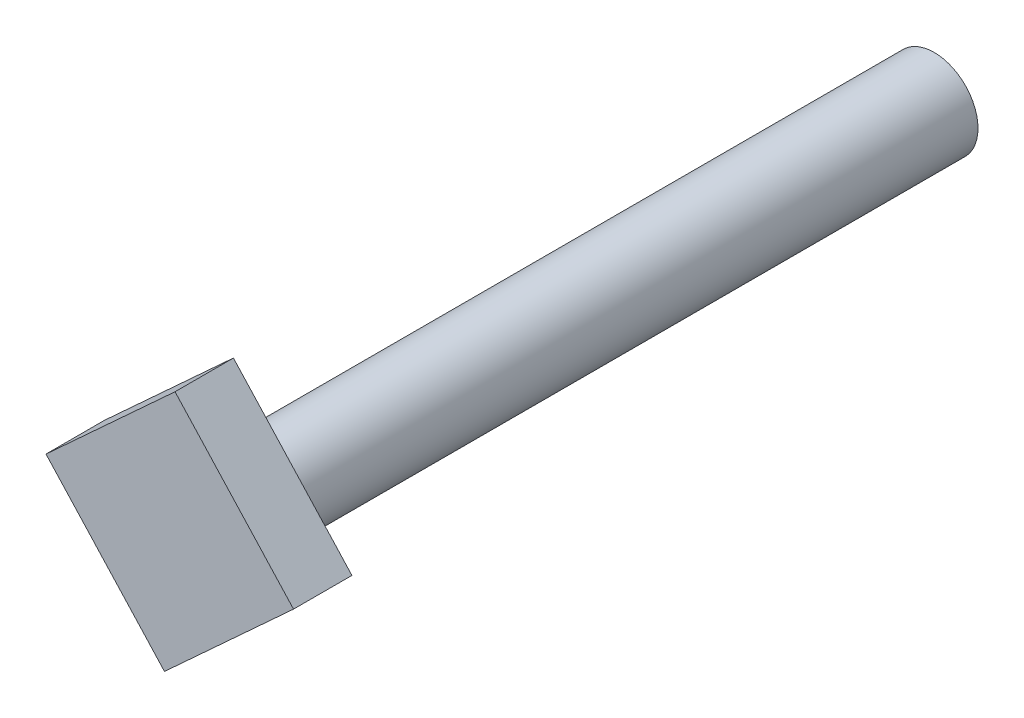
ISO-10303-21;
HEADER;
FILE_DESCRIPTION(('STEP AP214'),'2;1');
FILE_NAME('part.step','',(''),(''),'','','');
FILE_SCHEMA(('AUTOMOTIVE_DESIGN { 1 0 10303 214 1 1 1 1 }'));
ENDSEC;
DATA;
#1=APPLICATION_CONTEXT('core data for automotive mechanical design processes');
#2=APPLICATION_PROTOCOL_DEFINITION('international standard','automotive_design',2000,#1);
#3=PRODUCT_CONTEXT('',#1,'mechanical');
#4=PRODUCT('Part','Part','',(#3));
#5=PRODUCT_RELATED_PRODUCT_CATEGORY('part','',(#4));
#6=PRODUCT_DEFINITION_FORMATION('','',#4);
#7=PRODUCT_DEFINITION_CONTEXT('part definition',#1,'design');
#8=PRODUCT_DEFINITION('design','',#6,#7);
#9=PRODUCT_DEFINITION_SHAPE('','',#8);
#10=(LENGTH_UNIT() NAMED_UNIT(*) SI_UNIT(.MILLI.,.METRE.));
#11=(NAMED_UNIT(*) PLANE_ANGLE_UNIT() SI_UNIT($,.RADIAN.));
#12=(NAMED_UNIT(*) SI_UNIT($,.STERADIAN.) SOLID_ANGLE_UNIT());
#13=UNCERTAINTY_MEASURE_WITH_UNIT(LENGTH_MEASURE(1.E-05),#10,'distance_accuracy_value','');
#14=(GEOMETRIC_REPRESENTATION_CONTEXT(3) GLOBAL_UNCERTAINTY_ASSIGNED_CONTEXT((#13)) GLOBAL_UNIT_ASSIGNED_CONTEXT((#10,
#11,#12)) REPRESENTATION_CONTEXT('',''));
#15=CARTESIAN_POINT('',(0.,0.,0.));
#16=DIRECTION('',(0.,0.,1.));
#17=DIRECTION('',(1.,0.,0.));
#18=AXIS2_PLACEMENT_3D('',#15,#16,#17);
#19=CARTESIAN_POINT('',(0.,17.742533942898,-8.));
#20=DIRECTION('',(0.736588821414821,0.676340822490204,0.));
#21=DIRECTION('',(-0.676340822490204,0.736588821414821,0.));
#22=AXIS2_PLACEMENT_3D('',#19,#20,#21);
#23=PLANE('',#22);
#24=DIRECTION('',(-0.676340822490204,0.736588821414821,0.));
#25=VECTOR('',#24,1.);
#26=CARTESIAN_POINT('',(0.,17.742533942898,0.));
#27=LINE('',#26,#25);
#28=CARTESIAN_POINT('',(16.2321797397649,0.0644022289423118,0.));
#29=VERTEX_POINT('',#28);
#30=CARTESIAN_POINT('',(0.,17.742533942898,0.));
#31=VERTEX_POINT('',#30);
#32=EDGE_CURVE('E102',#29,#31,#27,.T.);
#33=ORIENTED_EDGE('',*,*,#32,.F.);
#34=DIRECTION('',(0.,0.,1.));
#35=VECTOR('',#34,1.);
#36=CARTESIAN_POINT('',(16.2321797397649,0.0644022289423118,-8.));
#37=LINE('',#36,#35);
#38=CARTESIAN_POINT('',(16.2321797397649,0.0644022289423118,-8.));
#39=VERTEX_POINT('',#38);
#40=EDGE_CURVE('E11',#39,#29,#37,.T.);
#41=ORIENTED_EDGE('',*,*,#40,.F.);
#42=DIRECTION('',(-0.676340822490204,0.736588821414821,0.));
#43=VECTOR('',#42,1.);
#44=CARTESIAN_POINT('',(0.,17.742533942898,-8.));
#45=LINE('',#44,#43);
#46=CARTESIAN_POINT('',(0.,17.742533942898,-8.));
#47=VERTEX_POINT('',#46);
#48=EDGE_CURVE('E95',#39,#47,#45,.T.);
#49=ORIENTED_EDGE('',*,*,#48,.T.);
#50=DIRECTION('',(0.,0.,1.));
#51=VECTOR('',#50,1.);
#52=CARTESIAN_POINT('',(0.,17.742533942898,-8.));
#53=LINE('',#52,#51);
#54=EDGE_CURVE('E40',#47,#31,#53,.T.);
#55=ORIENTED_EDGE('',*,*,#54,.T.);
#56=EDGE_LOOP('',(#33,#41,#49,#55));
#57=FACE_BOUND('',#56,.T.);
#58=ADVANCED_FACE('F37',(#57),#23,.T.);
#59=CARTESIAN_POINT('',(-1.4459519741908,-16.1677775108226,-8.));
#60=DIRECTION('',(0.676340822490204,-0.736588821414821,0.));
#61=DIRECTION('',(0.736588821414821,0.676340822490204,0.));
#62=AXIS2_PLACEMENT_3D('',#59,#60,#61);
#63=PLANE('',#62);
#64=DIRECTION('',(0.736588821414821,0.676340822490204,0.));
#65=VECTOR('',#64,1.);
#66=CARTESIAN_POINT('',(-1.4459519741908,-16.1677775108226,0.));
#67=LINE('',#66,#65);
#68=CARTESIAN_POINT('',(-1.4459519741908,-16.1677775108226,0.));
#69=VERTEX_POINT('',#68);
#70=EDGE_CURVE('E97',#69,#29,#67,.T.);
#71=ORIENTED_EDGE('',*,*,#70,.F.);
#72=DIRECTION('',(0.,0.,1.));
#73=VECTOR('',#72,1.);
#74=CARTESIAN_POINT('',(-1.4459519741908,-16.1677775108226,-8.));
#75=LINE('',#74,#73);
#76=CARTESIAN_POINT('',(-1.4459519741908,-16.1677775108226,-8.));
#77=VERTEX_POINT('',#76);
#78=EDGE_CURVE('E46',#77,#69,#75,.T.);
#79=ORIENTED_EDGE('',*,*,#78,.F.);
#80=DIRECTION('',(0.736588821414821,0.676340822490204,0.));
#81=VECTOR('',#80,1.);
#82=CARTESIAN_POINT('',(-1.4459519741908,-16.1677775108226,-8.));
#83=LINE('',#82,#81);
#84=EDGE_CURVE('E92',#77,#39,#83,.T.);
#85=ORIENTED_EDGE('',*,*,#84,.T.);
#86=ORIENTED_EDGE('',*,*,#40,.T.);
#87=EDGE_LOOP('',(#71,#79,#85,#86));
#88=FACE_BOUND('',#87,.T.);
#89=ADVANCED_FACE('F113',(#88),#63,.T.);
#90=CARTESIAN_POINT('',(-17.6781317139557,1.51035420313312,-8.));
#91=DIRECTION('',(-0.736588821414821,-0.676340822490204,0.));
#92=DIRECTION('',(0.676340822490204,-0.736588821414821,0.));
#93=AXIS2_PLACEMENT_3D('',#90,#91,#92);
#94=PLANE('',#93);
#95=DIRECTION('',(0.676340822490204,-0.736588821414821,0.));
#96=VECTOR('',#95,1.);
#97=CARTESIAN_POINT('',(-17.6781317139557,1.51035420313312,0.));
#98=LINE('',#97,#96);
#99=CARTESIAN_POINT('',(-17.6781317139557,1.51035420313312,0.));
#100=VERTEX_POINT('',#99);
#101=EDGE_CURVE('E87',#100,#69,#98,.T.);
#102=ORIENTED_EDGE('',*,*,#101,.F.);
#103=DIRECTION('',(0.,0.,1.));
#104=VECTOR('',#103,1.);
#105=CARTESIAN_POINT('',(-17.6781317139557,1.51035420313312,-8.));
#106=LINE('',#105,#104);
#107=CARTESIAN_POINT('',(-17.6781317139557,1.51035420313312,-8.));
#108=VERTEX_POINT('',#107);
#109=EDGE_CURVE('E82',#108,#100,#106,.T.);
#110=ORIENTED_EDGE('',*,*,#109,.F.);
#111=DIRECTION('',(0.676340822490204,-0.736588821414821,0.));
#112=VECTOR('',#111,1.);
#113=CARTESIAN_POINT('',(-17.6781317139557,1.51035420313312,-8.));
#114=LINE('',#113,#112);
#115=EDGE_CURVE('E85',#108,#77,#114,.T.);
#116=ORIENTED_EDGE('',*,*,#115,.T.);
#117=ORIENTED_EDGE('',*,*,#78,.T.);
#118=EDGE_LOOP('',(#102,#110,#116,#117));
#119=FACE_BOUND('',#118,.T.);
#120=ADVANCED_FACE('F84',(#119),#94,.T.);
#121=CARTESIAN_POINT('',(-17.6781317139557,1.51035420313312,-8.));
#122=DIRECTION('',(-0.676340822490204,0.736588821414821,0.));
#123=DIRECTION('',(-0.736588821414821,-0.676340822490204,0.));
#124=AXIS2_PLACEMENT_3D('',#121,#122,#123);
#125=PLANE('',#124);
#126=DIRECTION('',(-0.736588821414821,-0.676340822490204,0.));
#127=VECTOR('',#126,1.);
#128=CARTESIAN_POINT('',(-17.6781317139557,1.51035420313312,0.));
#129=LINE('',#128,#127);
#130=EDGE_CURVE('E105',#31,#100,#129,.T.);
#131=ORIENTED_EDGE('',*,*,#130,.F.);
#132=ORIENTED_EDGE('',*,*,#54,.F.);
#133=DIRECTION('',(-0.736588821414821,-0.676340822490204,0.));
#134=VECTOR('',#133,1.);
#135=CARTESIAN_POINT('',(-17.6781317139557,1.51035420313312,-8.));
#136=LINE('',#135,#134);
#137=EDGE_CURVE('E91',#47,#108,#136,.T.);
#138=ORIENTED_EDGE('',*,*,#137,.T.);
#139=ORIENTED_EDGE('',*,*,#109,.T.);
#140=EDGE_LOOP('',(#131,#132,#138,#139));
#141=FACE_BOUND('',#140,.T.);
#142=ADVANCED_FACE('F94',(#141),#125,.T.);
#143=CARTESIAN_POINT('',(0.,0.,-8.));
#144=DIRECTION('',(0.,0.,1.));
#145=DIRECTION('',(1.,0.,0.));
#146=AXIS2_PLACEMENT_3D('',#143,#144,#145);
#147=PLANE('',#146);
#148=CARTESIAN_POINT('',(0.,0.,-7.99999999999999));
#149=DIRECTION('',(0.,0.,1.));
#150=DIRECTION('',(1.,0.,0.));
#151=AXIS2_PLACEMENT_3D('',#148,#149,#150);
#152=CIRCLE('',#151,6.);
#153=CARTESIAN_POINT('',(6.,0.,-7.99999999999999));
#154=VERTEX_POINT('',#153);
#155=EDGE_CURVE('E106',#154,#154,#152,.T.);
#156=ORIENTED_EDGE('',*,*,#155,.T.);
#157=EDGE_LOOP('',(#156));
#158=FACE_BOUND('',#157,.T.);
#159=ORIENTED_EDGE('',*,*,#48,.F.);
#160=ORIENTED_EDGE('',*,*,#84,.F.);
#161=ORIENTED_EDGE('',*,*,#115,.F.);
#162=ORIENTED_EDGE('',*,*,#137,.F.);
#163=EDGE_LOOP('',(#159,#160,#161,#162));
#164=FACE_BOUND('',#163,.T.);
#165=ADVANCED_FACE('F90',(#158,#164),#147,.F.);
#166=CARTESIAN_POINT('',(0.,0.,0.));
#167=DIRECTION('',(0.,0.,1.));
#168=DIRECTION('',(1.,0.,0.));
#169=AXIS2_PLACEMENT_3D('',#166,#167,#168);
#170=PLANE('',#169);
#171=ORIENTED_EDGE('',*,*,#32,.T.);
#172=ORIENTED_EDGE('',*,*,#130,.T.);
#173=ORIENTED_EDGE('',*,*,#101,.T.);
#174=ORIENTED_EDGE('',*,*,#70,.T.);
#175=EDGE_LOOP('',(#171,#172,#173,#174));
#176=FACE_BOUND('',#175,.T.);
#177=ADVANCED_FACE('F112',(#176),#170,.T.);
#178=CARTESIAN_POINT('',(0.,0.,-104.));
#179=DIRECTION('',(0.,0.,1.));
#180=DIRECTION('',(1.,0.,0.));
#181=AXIS2_PLACEMENT_3D('',#178,#179,#180);
#182=CYLINDRICAL_SURFACE('',#181,6.);
#183=CARTESIAN_POINT('',(0.,0.,-104.));
#184=DIRECTION('',(0.,0.,1.));
#185=DIRECTION('',(1.,0.,0.));
#186=AXIS2_PLACEMENT_3D('',#183,#184,#185);
#187=CIRCLE('',#186,6.);
#188=CARTESIAN_POINT('',(6.,0.,-104.));
#189=VERTEX_POINT('',#188);
#190=EDGE_CURVE('E144',#189,#189,#187,.T.);
#191=ORIENTED_EDGE('',*,*,#190,.T.);
#192=EDGE_LOOP('',(#191));
#193=FACE_BOUND('',#192,.T.);
#194=ORIENTED_EDGE('',*,*,#155,.F.);
#195=EDGE_LOOP('',(#194));
#196=FACE_BOUND('',#195,.T.);
#197=ADVANCED_FACE('F131',(#193,#196),#182,.T.);
#198=CARTESIAN_POINT('',(0.,0.,-104.));
#199=DIRECTION('',(0.,0.,1.));
#200=DIRECTION('',(1.,0.,0.));
#201=AXIS2_PLACEMENT_3D('',#198,#199,#200);
#202=PLANE('',#201);
#203=ORIENTED_EDGE('',*,*,#190,.F.);
#204=EDGE_LOOP('',(#203));
#205=FACE_BOUND('',#204,.T.);
#206=ADVANCED_FACE('F136',(#205),#202,.F.);
#207=CLOSED_SHELL('',(#58,#89,#120,#142,#165,#177,#197,#206));
#208=MANIFOLD_SOLID_BREP('B2',#207);
#209=ADVANCED_BREP_SHAPE_REPRESENTATION('',(#18,#208),#14);
#210=SHAPE_DEFINITION_REPRESENTATION(#9,#209);
ENDSEC;
END-ISO-10303-21;
